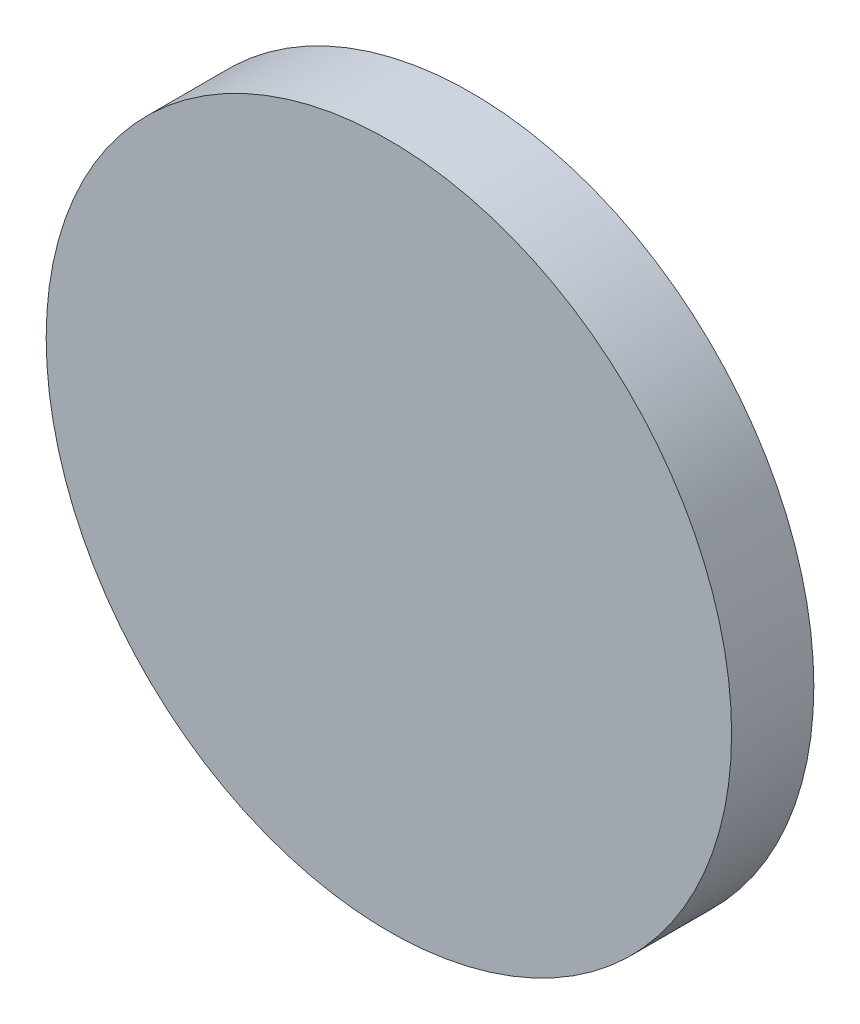
ISO-10303-21;
HEADER;
FILE_DESCRIPTION(('STEP AP214'),'2;1');
FILE_NAME('part.step','',(''),(''),'','','');
FILE_SCHEMA(('AUTOMOTIVE_DESIGN { 1 0 10303 214 1 1 1 1 }'));
ENDSEC;
DATA;
#1=APPLICATION_CONTEXT('core data for automotive mechanical design processes');
#2=APPLICATION_PROTOCOL_DEFINITION('international standard','automotive_design',2000,#1);
#3=PRODUCT_CONTEXT('',#1,'mechanical');
#4=PRODUCT('Part','Part','',(#3));
#5=PRODUCT_RELATED_PRODUCT_CATEGORY('part','',(#4));
#6=PRODUCT_DEFINITION_FORMATION('','',#4);
#7=PRODUCT_DEFINITION_CONTEXT('part definition',#1,'design');
#8=PRODUCT_DEFINITION('design','',#6,#7);
#9=PRODUCT_DEFINITION_SHAPE('','',#8);
#10=(LENGTH_UNIT() NAMED_UNIT(*) SI_UNIT(.MILLI.,.METRE.));
#11=(NAMED_UNIT(*) PLANE_ANGLE_UNIT() SI_UNIT($,.RADIAN.));
#12=(NAMED_UNIT(*) SI_UNIT($,.STERADIAN.) SOLID_ANGLE_UNIT());
#13=UNCERTAINTY_MEASURE_WITH_UNIT(LENGTH_MEASURE(1.E-05),#10,'distance_accuracy_value','');
#14=(GEOMETRIC_REPRESENTATION_CONTEXT(3) GLOBAL_UNCERTAINTY_ASSIGNED_CONTEXT((#13)) GLOBAL_UNIT_ASSIGNED_CONTEXT((#10,
#11,#12)) REPRESENTATION_CONTEXT('',''));
#15=CARTESIAN_POINT('',(0.,0.,0.));
#16=DIRECTION('',(0.,0.,1.));
#17=DIRECTION('',(1.,0.,0.));
#18=AXIS2_PLACEMENT_3D('',#15,#16,#17);
#19=CARTESIAN_POINT('',(0.,0.,7.62));
#20=DIRECTION('',(0.,0.,-1.));
#21=DIRECTION('',(-1.,0.,0.));
#22=AXIS2_PLACEMENT_3D('',#19,#20,#21);
#23=CYLINDRICAL_SURFACE('',#22,31.75);
#24=CARTESIAN_POINT('',(0.,0.,7.62));
#25=DIRECTION('',(0.,0.,1.));
#26=DIRECTION('',(1.,0.,0.));
#27=AXIS2_PLACEMENT_3D('',#24,#25,#26);
#28=CIRCLE('',#27,31.75);
#29=CARTESIAN_POINT('',(31.75,0.,7.62));
#30=VERTEX_POINT('',#29);
#31=EDGE_CURVE('E10',#30,#30,#28,.T.);
#32=ORIENTED_EDGE('',*,*,#31,.F.);
#33=EDGE_LOOP('',(#32));
#34=FACE_BOUND('',#33,.T.);
#35=CARTESIAN_POINT('',(0.,0.,0.));
#36=DIRECTION('',(0.,0.,1.));
#37=DIRECTION('',(1.,0.,0.));
#38=AXIS2_PLACEMENT_3D('',#35,#36,#37);
#39=CIRCLE('',#38,31.75);
#40=CARTESIAN_POINT('',(31.75,0.,0.));
#41=VERTEX_POINT('',#40);
#42=EDGE_CURVE('E40',#41,#41,#39,.T.);
#43=ORIENTED_EDGE('',*,*,#42,.T.);
#44=EDGE_LOOP('',(#43));
#45=FACE_BOUND('',#44,.T.);
#46=ADVANCED_FACE('F37',(#34,#45),#23,.T.);
#47=CARTESIAN_POINT('',(0.,0.,7.62));
#48=DIRECTION('',(0.,0.,1.));
#49=DIRECTION('',(1.,0.,0.));
#50=AXIS2_PLACEMENT_3D('',#47,#48,#49);
#51=PLANE('',#50);
#52=ORIENTED_EDGE('',*,*,#31,.T.);
#53=EDGE_LOOP('',(#52));
#54=FACE_BOUND('',#53,.T.);
#55=ADVANCED_FACE('F54',(#54),#51,.T.);
#56=CARTESIAN_POINT('',(0.,0.,0.));
#57=DIRECTION('',(0.,0.,1.));
#58=DIRECTION('',(1.,0.,0.));
#59=AXIS2_PLACEMENT_3D('',#56,#57,#58);
#60=PLANE('',#59);
#61=ORIENTED_EDGE('',*,*,#42,.F.);
#62=EDGE_LOOP('',(#61));
#63=FACE_BOUND('',#62,.T.);
#64=ADVANCED_FACE('F52',(#63),#60,.F.);
#65=CLOSED_SHELL('',(#46,#55,#64));
#66=MANIFOLD_SOLID_BREP('B2',#65);
#67=ADVANCED_BREP_SHAPE_REPRESENTATION('',(#18,#66),#14);
#68=SHAPE_DEFINITION_REPRESENTATION(#9,#67);
ENDSEC;
END-ISO-10303-21;
